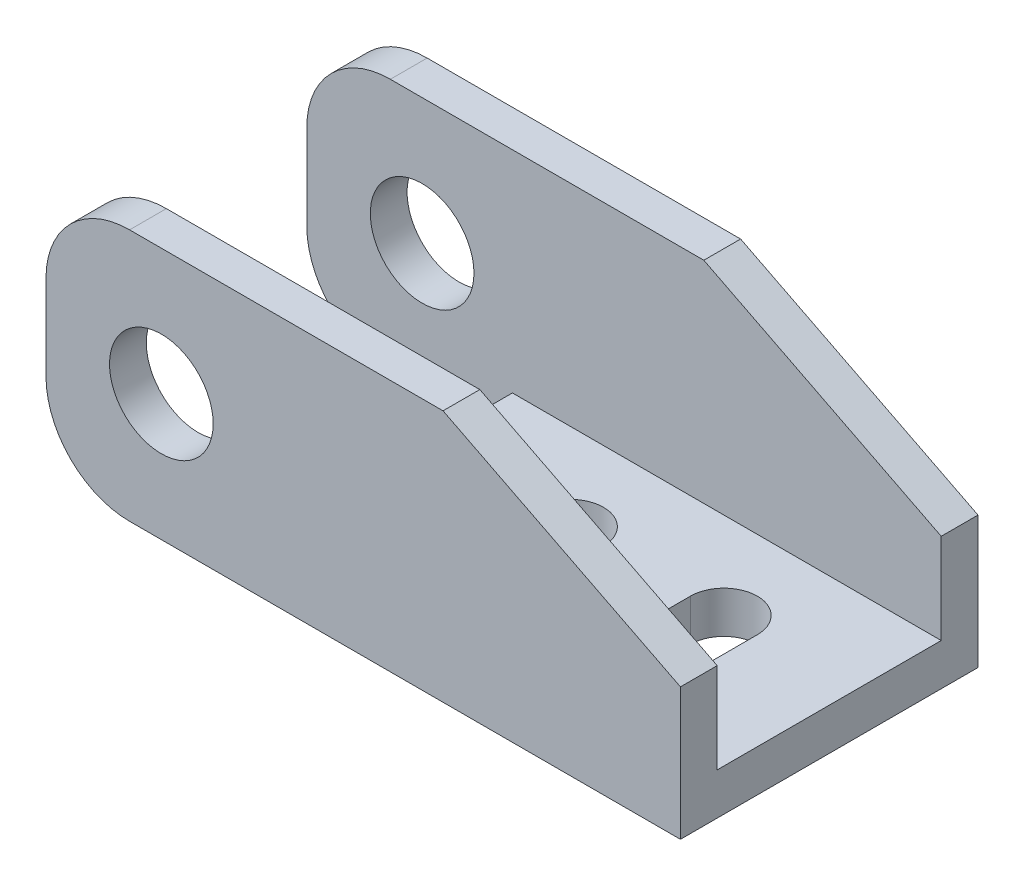
ISO-10303-21;
HEADER;
FILE_DESCRIPTION(('STEP AP214'),'2;1');
FILE_NAME('part.step','',(''),(''),'','','');
FILE_SCHEMA(('AUTOMOTIVE_DESIGN { 1 0 10303 214 1 1 1 1 }'));
ENDSEC;
DATA;
#1=APPLICATION_CONTEXT('core data for automotive mechanical design processes');
#2=APPLICATION_PROTOCOL_DEFINITION('international standard','automotive_design',2000,#1);
#3=PRODUCT_CONTEXT('',#1,'mechanical');
#4=PRODUCT('Part','Part','',(#3));
#5=PRODUCT_RELATED_PRODUCT_CATEGORY('part','',(#4));
#6=PRODUCT_DEFINITION_FORMATION('','',#4);
#7=PRODUCT_DEFINITION_CONTEXT('part definition',#1,'design');
#8=PRODUCT_DEFINITION('design','',#6,#7);
#9=PRODUCT_DEFINITION_SHAPE('','',#8);
#10=(LENGTH_UNIT() NAMED_UNIT(*) SI_UNIT(.MILLI.,.METRE.));
#11=(NAMED_UNIT(*) PLANE_ANGLE_UNIT() SI_UNIT($,.RADIAN.));
#12=(NAMED_UNIT(*) SI_UNIT($,.STERADIAN.) SOLID_ANGLE_UNIT());
#13=UNCERTAINTY_MEASURE_WITH_UNIT(LENGTH_MEASURE(1.E-05),#10,'distance_accuracy_value','');
#14=(GEOMETRIC_REPRESENTATION_CONTEXT(3) GLOBAL_UNCERTAINTY_ASSIGNED_CONTEXT((#13)) GLOBAL_UNIT_ASSIGNED_CONTEXT((#10,
#11,#12)) REPRESENTATION_CONTEXT('',''));
#15=CARTESIAN_POINT('',(0.,0.,0.));
#16=DIRECTION('',(0.,0.,1.));
#17=DIRECTION('',(1.,0.,0.));
#18=AXIS2_PLACEMENT_3D('',#15,#16,#17);
#19=CARTESIAN_POINT('',(12.825,2.5,8.9));
#20=DIRECTION('',(-1.,0.,0.));
#21=DIRECTION('',(0.,0.,1.));
#22=AXIS2_PLACEMENT_3D('',#19,#20,#21);
#23=PLANE('',#22);
#24=DIRECTION('',(0.,0.,-1.));
#25=VECTOR('',#24,1.);
#26=CARTESIAN_POINT('',(12.825,0.,8.9));
#27=LINE('',#26,#25);
#28=CARTESIAN_POINT('',(12.825,0.,8.9));
#29=VERTEX_POINT('',#28);
#30=CARTESIAN_POINT('',(12.825,0.,-8.9));
#31=VERTEX_POINT('',#30);
#32=EDGE_CURVE('E341',#29,#31,#27,.T.);
#33=ORIENTED_EDGE('',*,*,#32,.T.);
#34=DIRECTION('',(0.,-1.,0.));
#35=VECTOR('',#34,1.);
#36=CARTESIAN_POINT('',(12.825,2.5,-8.9));
#37=LINE('',#36,#35);
#38=CARTESIAN_POINT('',(12.825,7.9,-8.9));
#39=VERTEX_POINT('',#38);
#40=EDGE_CURVE('E358',#39,#31,#37,.T.);
#41=ORIENTED_EDGE('',*,*,#40,.F.);
#42=DIRECTION('',(0.,0.,-1.));
#43=VECTOR('',#42,1.);
#44=CARTESIAN_POINT('',(12.825,7.9,-6.7));
#45=LINE('',#44,#43);
#46=CARTESIAN_POINT('',(12.825,7.9,-6.7));
#47=VERTEX_POINT('',#46);
#48=EDGE_CURVE('E300',#47,#39,#45,.T.);
#49=ORIENTED_EDGE('',*,*,#48,.F.);
#50=DIRECTION('',(0.,1.,0.));
#51=VECTOR('',#50,1.);
#52=CARTESIAN_POINT('',(12.825,7.9,-6.7));
#53=LINE('',#52,#51);
#54=CARTESIAN_POINT('',(12.825,2.5,-6.7));
#55=VERTEX_POINT('',#54);
#56=EDGE_CURVE('E289',#55,#47,#53,.T.);
#57=ORIENTED_EDGE('',*,*,#56,.F.);
#58=DIRECTION('',(0.,0.,-1.));
#59=VECTOR('',#58,1.);
#60=CARTESIAN_POINT('',(12.825,2.5,8.9));
#61=LINE('',#60,#59);
#62=CARTESIAN_POINT('',(12.825,2.5,6.7));
#63=VERTEX_POINT('',#62);
#64=EDGE_CURVE('E342',#63,#55,#61,.T.);
#65=ORIENTED_EDGE('',*,*,#64,.F.);
#66=DIRECTION('',(0.,1.,0.));
#67=VECTOR('',#66,1.);
#68=CARTESIAN_POINT('',(12.825,7.9,6.7));
#69=LINE('',#68,#67);
#70=CARTESIAN_POINT('',(12.825,7.9,6.7));
#71=VERTEX_POINT('',#70);
#72=EDGE_CURVE('E316',#63,#71,#69,.T.);
#73=ORIENTED_EDGE('',*,*,#72,.T.);
#74=DIRECTION('',(0.,0.,1.));
#75=VECTOR('',#74,1.);
#76=CARTESIAN_POINT('',(12.825,7.9,6.7));
#77=LINE('',#76,#75);
#78=CARTESIAN_POINT('',(12.825,7.9,8.9));
#79=VERTEX_POINT('',#78);
#80=EDGE_CURVE('E324',#71,#79,#77,.T.);
#81=ORIENTED_EDGE('',*,*,#80,.T.);
#82=DIRECTION('',(0.,-1.,0.));
#83=VECTOR('',#82,1.);
#84=CARTESIAN_POINT('',(12.825,2.5,8.9));
#85=LINE('',#84,#83);
#86=EDGE_CURVE('E347',#79,#29,#85,.T.);
#87=ORIENTED_EDGE('',*,*,#86,.T.);
#88=EDGE_LOOP('',(#33,#41,#49,#57,#65,#73,#81,#87));
#89=FACE_BOUND('',#88,.T.);
#90=ADVANCED_FACE('F32',(#89),#23,.F.);
#91=CARTESIAN_POINT('',(-12.825,2.5,-8.9));
#92=DIRECTION('',(0.,0.,1.));
#93=DIRECTION('',(1.,0.,0.));
#94=AXIS2_PLACEMENT_3D('',#91,#92,#93);
#95=PLANE('',#94);
#96=CARTESIAN_POINT('',(-18.225,7.55,-8.9));
#97=DIRECTION('',(0.,0.,1.));
#98=DIRECTION('',(1.,0.,0.));
#99=AXIS2_PLACEMENT_3D('',#96,#97,#98);
#100=CIRCLE('',#99,3.1);
#101=CARTESIAN_POINT('',(-15.125,7.55,-8.9));
#102=VERTEX_POINT('',#101);
#103=EDGE_CURVE('E270',#102,#102,#100,.T.);
#104=ORIENTED_EDGE('',*,*,#103,.T.);
#105=EDGE_LOOP('',(#104));
#106=FACE_BOUND('',#105,.T.);
#107=DIRECTION('',(-1.,0.,0.));
#108=VECTOR('',#107,1.);
#109=CARTESIAN_POINT('',(-12.825,0.,-8.9));
#110=LINE('',#109,#108);
#111=CARTESIAN_POINT('',(-20.125,0.,-8.9));
#112=VERTEX_POINT('',#111);
#113=EDGE_CURVE('E349',#31,#112,#110,.T.);
#114=ORIENTED_EDGE('',*,*,#113,.T.);
#115=CARTESIAN_POINT('',(-20.125,5.,-8.9));
#116=DIRECTION('',(0.,0.,1.));
#117=DIRECTION('',(1.,0.,0.));
#118=AXIS2_PLACEMENT_3D('',#115,#116,#117);
#119=CIRCLE('',#118,5.);
#120=CARTESIAN_POINT('',(-25.125,5.,-8.9));
#121=VERTEX_POINT('',#120);
#122=EDGE_CURVE('E370',#112,#121,#119,.F.);
#123=ORIENTED_EDGE('',*,*,#122,.T.);
#124=DIRECTION('',(0.,-1.,0.));
#125=VECTOR('',#124,1.);
#126=CARTESIAN_POINT('',(-25.125,0.,-8.9));
#127=LINE('',#126,#125);
#128=CARTESIAN_POINT('',(-25.125,10.1,-8.9));
#129=VERTEX_POINT('',#128);
#130=EDGE_CURVE('E279',#129,#121,#127,.T.);
#131=ORIENTED_EDGE('',*,*,#130,.F.);
#132=CARTESIAN_POINT('',(-20.125,10.1,-8.9));
#133=DIRECTION('',(0.,0.,1.));
#134=DIRECTION('',(1.,0.,0.));
#135=AXIS2_PLACEMENT_3D('',#132,#133,#134);
#136=CIRCLE('',#135,5.);
#137=CARTESIAN_POINT('',(-20.125,15.1,-8.9));
#138=VERTEX_POINT('',#137);
#139=EDGE_CURVE('E368',#129,#138,#136,.F.);
#140=ORIENTED_EDGE('',*,*,#139,.T.);
#141=DIRECTION('',(-1.,0.,0.));
#142=VECTOR('',#141,1.);
#143=CARTESIAN_POINT('',(-25.125,15.1,-8.9));
#144=LINE('',#143,#142);
#145=CARTESIAN_POINT('',(-1.375,15.1,-8.9));
#146=VERTEX_POINT('',#145);
#147=EDGE_CURVE('E296',#146,#138,#144,.T.);
#148=ORIENTED_EDGE('',*,*,#147,.F.);
#149=DIRECTION('',(-0.891900680243053,0.452231330827464,0.));
#150=VECTOR('',#149,1.);
#151=CARTESIAN_POINT('',(-1.375,15.1,-8.9));
#152=LINE('',#151,#150);
#153=EDGE_CURVE('E284',#39,#146,#152,.T.);
#154=ORIENTED_EDGE('',*,*,#153,.F.);
#155=ORIENTED_EDGE('',*,*,#40,.T.);
#156=EDGE_LOOP('',(#114,#123,#131,#140,#148,#154,#155));
#157=FACE_BOUND('',#156,.T.);
#158=ADVANCED_FACE('F441',(#106,#157),#95,.F.);
#159=CARTESIAN_POINT('',(-12.825,2.5,8.9));
#160=DIRECTION('',(1.,0.,0.));
#161=DIRECTION('',(0.,0.,-1.));
#162=AXIS2_PLACEMENT_3D('',#159,#160,#161);
#163=PLANE('',#162);
#164=DIRECTION('',(0.,0.,1.));
#165=VECTOR('',#164,1.);
#166=CARTESIAN_POINT('',(-12.825,2.5,8.9));
#167=LINE('',#166,#165);
#168=CARTESIAN_POINT('',(-12.825,2.5,-6.7));
#169=VERTEX_POINT('',#168);
#170=CARTESIAN_POINT('',(-12.825,2.5,6.7));
#171=VERTEX_POINT('',#170);
#172=EDGE_CURVE('E344',#169,#171,#167,.T.);
#173=ORIENTED_EDGE('',*,*,#172,.F.);
#174=DIRECTION('',(0.,-1.,0.));
#175=VECTOR('',#174,1.);
#176=CARTESIAN_POINT('',(-12.825,2.5,-6.7));
#177=LINE('',#176,#175);
#178=CARTESIAN_POINT('',(-12.825,0.,-6.7));
#179=VERTEX_POINT('',#178);
#180=EDGE_CURVE('E307',#169,#179,#177,.T.);
#181=ORIENTED_EDGE('',*,*,#180,.T.);
#182=DIRECTION('',(0.,0.,1.));
#183=VECTOR('',#182,1.);
#184=CARTESIAN_POINT('',(-12.825,0.,8.9));
#185=LINE('',#184,#183);
#186=CARTESIAN_POINT('',(-12.825,0.,6.7));
#187=VERTEX_POINT('',#186);
#188=EDGE_CURVE('E352',#179,#187,#185,.T.);
#189=ORIENTED_EDGE('',*,*,#188,.T.);
#190=DIRECTION('',(0.,1.,0.));
#191=VECTOR('',#190,1.);
#192=CARTESIAN_POINT('',(-12.825,2.5,6.7));
#193=LINE('',#192,#191);
#194=EDGE_CURVE('E338',#187,#171,#193,.T.);
#195=ORIENTED_EDGE('',*,*,#194,.T.);
#196=EDGE_LOOP('',(#173,#181,#189,#195));
#197=FACE_BOUND('',#196,.T.);
#198=ADVANCED_FACE('F430',(#197),#163,.F.);
#199=CARTESIAN_POINT('',(-12.825,2.5,8.9));
#200=DIRECTION('',(0.,0.,-1.));
#201=DIRECTION('',(-1.,0.,0.));
#202=AXIS2_PLACEMENT_3D('',#199,#200,#201);
#203=PLANE('',#202);
#204=CARTESIAN_POINT('',(-18.225,7.55,8.9));
#205=DIRECTION('',(0.,0.,1.));
#206=DIRECTION('',(1.,0.,0.));
#207=AXIS2_PLACEMENT_3D('',#204,#205,#206);
#208=CIRCLE('',#207,3.1);
#209=CARTESIAN_POINT('',(-15.125,7.55,8.9));
#210=VERTEX_POINT('',#209);
#211=EDGE_CURVE('E269',#210,#210,#208,.T.);
#212=ORIENTED_EDGE('',*,*,#211,.F.);
#213=EDGE_LOOP('',(#212));
#214=FACE_BOUND('',#213,.T.);
#215=DIRECTION('',(-1.,0.,0.));
#216=VECTOR('',#215,1.);
#217=CARTESIAN_POINT('',(-25.125,15.1,8.9));
#218=LINE('',#217,#216);
#219=CARTESIAN_POINT('',(-1.375,15.1,8.9));
#220=VERTEX_POINT('',#219);
#221=CARTESIAN_POINT('',(-20.125,15.1,8.9));
#222=VERTEX_POINT('',#221);
#223=EDGE_CURVE('E314',#220,#222,#218,.T.);
#224=ORIENTED_EDGE('',*,*,#223,.T.);
#225=CARTESIAN_POINT('',(-20.125,10.1,8.9));
#226=DIRECTION('',(0.,0.,-1.));
#227=DIRECTION('',(-1.,0.,0.));
#228=AXIS2_PLACEMENT_3D('',#225,#226,#227);
#229=CIRCLE('',#228,5.);
#230=CARTESIAN_POINT('',(-25.125,10.1,8.9));
#231=VERTEX_POINT('',#230);
#232=EDGE_CURVE('E388',#222,#231,#229,.F.);
#233=ORIENTED_EDGE('',*,*,#232,.T.);
#234=DIRECTION('',(0.,-1.,0.));
#235=VECTOR('',#234,1.);
#236=CARTESIAN_POINT('',(-25.125,0.,8.9));
#237=LINE('',#236,#235);
#238=CARTESIAN_POINT('',(-25.125,5.,8.9));
#239=VERTEX_POINT('',#238);
#240=EDGE_CURVE('E310',#231,#239,#237,.T.);
#241=ORIENTED_EDGE('',*,*,#240,.T.);
#242=CARTESIAN_POINT('',(-20.125,5.,8.9));
#243=DIRECTION('',(0.,0.,-1.));
#244=DIRECTION('',(-1.,0.,0.));
#245=AXIS2_PLACEMENT_3D('',#242,#243,#244);
#246=CIRCLE('',#245,5.);
#247=CARTESIAN_POINT('',(-20.125,0.,8.9));
#248=VERTEX_POINT('',#247);
#249=EDGE_CURVE('E386',#239,#248,#246,.F.);
#250=ORIENTED_EDGE('',*,*,#249,.T.);
#251=DIRECTION('',(1.,0.,0.));
#252=VECTOR('',#251,1.);
#253=CARTESIAN_POINT('',(-12.825,0.,8.9));
#254=LINE('',#253,#252);
#255=EDGE_CURVE('E345',#248,#29,#254,.T.);
#256=ORIENTED_EDGE('',*,*,#255,.T.);
#257=ORIENTED_EDGE('',*,*,#86,.F.);
#258=DIRECTION('',(-0.891900680243053,0.452231330827464,0.));
#259=VECTOR('',#258,1.);
#260=CARTESIAN_POINT('',(-1.375,15.1,8.9));
#261=LINE('',#260,#259);
#262=EDGE_CURVE('E327',#79,#220,#261,.T.);
#263=ORIENTED_EDGE('',*,*,#262,.T.);
#264=EDGE_LOOP('',(#224,#233,#241,#250,#256,#257,#263));
#265=FACE_BOUND('',#264,.T.);
#266=ADVANCED_FACE('F397',(#214,#265),#203,.F.);
#267=CARTESIAN_POINT('',(0.,2.5,0.));
#268=DIRECTION('',(0.,-1.,0.));
#269=DIRECTION('',(0.,0.,-1.));
#270=AXIS2_PLACEMENT_3D('',#267,#268,#269);
#271=PLANE('',#270);
#272=DIRECTION('',(0.,0.,-1.));
#273=VECTOR('',#272,1.);
#274=CARTESIAN_POINT('',(3.025,2.5,0.));
#275=LINE('',#274,#273);
#276=CARTESIAN_POINT('',(3.025,2.5,1.5));
#277=VERTEX_POINT('',#276);
#278=CARTESIAN_POINT('',(3.025,2.5,-1.5));
#279=VERTEX_POINT('',#278);
#280=EDGE_CURVE('E231',#277,#279,#275,.T.);
#281=ORIENTED_EDGE('',*,*,#280,.T.);
#282=CARTESIAN_POINT('',(5.025,2.5,-1.5));
#283=DIRECTION('',(0.,-1.,0.));
#284=DIRECTION('',(0.,0.,-1.));
#285=AXIS2_PLACEMENT_3D('',#282,#283,#284);
#286=CIRCLE('',#285,2.);
#287=CARTESIAN_POINT('',(7.025,2.5,-1.5));
#288=VERTEX_POINT('',#287);
#289=EDGE_CURVE('E234',#279,#288,#286,.T.);
#290=ORIENTED_EDGE('',*,*,#289,.T.);
#291=DIRECTION('',(0.,0.,1.));
#292=VECTOR('',#291,1.);
#293=CARTESIAN_POINT('',(7.025,2.5,0.));
#294=LINE('',#293,#292);
#295=CARTESIAN_POINT('',(7.025,2.5,1.5));
#296=VERTEX_POINT('',#295);
#297=EDGE_CURVE('E226',#288,#296,#294,.T.);
#298=ORIENTED_EDGE('',*,*,#297,.T.);
#299=CARTESIAN_POINT('',(5.025,2.5,1.5));
#300=DIRECTION('',(0.,-1.,0.));
#301=DIRECTION('',(0.,0.,-1.));
#302=AXIS2_PLACEMENT_3D('',#299,#300,#301);
#303=CIRCLE('',#302,2.);
#304=EDGE_CURVE('E201',#296,#277,#303,.T.);
#305=ORIENTED_EDGE('',*,*,#304,.T.);
#306=EDGE_LOOP('',(#281,#290,#298,#305));
#307=FACE_BOUND('',#306,.T.);
#308=DIRECTION('',(0.,0.,1.));
#309=VECTOR('',#308,1.);
#310=CARTESIAN_POINT('',(-2.175,2.5,0.));
#311=LINE('',#310,#309);
#312=CARTESIAN_POINT('',(-2.175,2.5,-1.5));
#313=VERTEX_POINT('',#312);
#314=CARTESIAN_POINT('',(-2.175,2.5,1.5));
#315=VERTEX_POINT('',#314);
#316=EDGE_CURVE('E263',#313,#315,#311,.T.);
#317=ORIENTED_EDGE('',*,*,#316,.T.);
#318=CARTESIAN_POINT('',(-4.175,2.5,1.5));
#319=DIRECTION('',(0.,-1.,0.));
#320=DIRECTION('',(0.,0.,-1.));
#321=AXIS2_PLACEMENT_3D('',#318,#319,#320);
#322=CIRCLE('',#321,2.);
#323=CARTESIAN_POINT('',(-6.175,2.5,1.5));
#324=VERTEX_POINT('',#323);
#325=EDGE_CURVE('E266',#315,#324,#322,.T.);
#326=ORIENTED_EDGE('',*,*,#325,.T.);
#327=DIRECTION('',(0.,0.,-1.));
#328=VECTOR('',#327,1.);
#329=CARTESIAN_POINT('',(-6.175,2.5,0.));
#330=LINE('',#329,#328);
#331=CARTESIAN_POINT('',(-6.175,2.5,-1.5));
#332=VERTEX_POINT('',#331);
#333=EDGE_CURVE('E251',#324,#332,#330,.T.);
#334=ORIENTED_EDGE('',*,*,#333,.T.);
#335=CARTESIAN_POINT('',(-4.175,2.5,-1.5));
#336=DIRECTION('',(0.,-1.,0.));
#337=DIRECTION('',(0.,0.,-1.));
#338=AXIS2_PLACEMENT_3D('',#335,#336,#337);
#339=CIRCLE('',#338,2.);
#340=EDGE_CURVE('E260',#332,#313,#339,.T.);
#341=ORIENTED_EDGE('',*,*,#340,.T.);
#342=EDGE_LOOP('',(#317,#326,#334,#341));
#343=FACE_BOUND('',#342,.T.);
#344=ORIENTED_EDGE('',*,*,#64,.T.);
#345=DIRECTION('',(-1.,0.,0.));
#346=VECTOR('',#345,1.);
#347=CARTESIAN_POINT('',(0.,2.5,-6.7));
#348=LINE('',#347,#346);
#349=EDGE_CURVE('E303',#55,#169,#348,.T.);
#350=ORIENTED_EDGE('',*,*,#349,.T.);
#351=ORIENTED_EDGE('',*,*,#172,.T.);
#352=DIRECTION('',(1.,0.,0.));
#353=VECTOR('',#352,1.);
#354=CARTESIAN_POINT('',(0.,2.5,6.7));
#355=LINE('',#354,#353);
#356=EDGE_CURVE('E334',#171,#63,#355,.T.);
#357=ORIENTED_EDGE('',*,*,#356,.T.);
#358=EDGE_LOOP('',(#344,#350,#351,#357));
#359=FACE_BOUND('',#358,.T.);
#360=ADVANCED_FACE('F422',(#307,#343,#359),#271,.F.);
#361=CARTESIAN_POINT('',(0.,0.,0.));
#362=DIRECTION('',(0.,-1.,0.));
#363=DIRECTION('',(0.,0.,-1.));
#364=AXIS2_PLACEMENT_3D('',#361,#362,#363);
#365=PLANE('',#364);
#366=CARTESIAN_POINT('',(5.025,0.,-1.5));
#367=DIRECTION('',(0.,-1.,0.));
#368=DIRECTION('',(0.,0.,-1.));
#369=AXIS2_PLACEMENT_3D('',#366,#367,#368);
#370=CIRCLE('',#369,2.);
#371=CARTESIAN_POINT('',(3.025,0.,-1.5));
#372=VERTEX_POINT('',#371);
#373=CARTESIAN_POINT('',(7.025,0.,-1.5));
#374=VERTEX_POINT('',#373);
#375=EDGE_CURVE('E214',#372,#374,#370,.T.);
#376=ORIENTED_EDGE('',*,*,#375,.F.);
#377=DIRECTION('',(0.,0.,-1.));
#378=VECTOR('',#377,1.);
#379=CARTESIAN_POINT('',(3.025,0.,-1.5));
#380=LINE('',#379,#378);
#381=CARTESIAN_POINT('',(3.025,0.,1.5));
#382=VERTEX_POINT('',#381);
#383=EDGE_CURVE('E219',#382,#372,#380,.T.);
#384=ORIENTED_EDGE('',*,*,#383,.F.);
#385=CARTESIAN_POINT('',(5.025,0.,1.5));
#386=DIRECTION('',(0.,-1.,0.));
#387=DIRECTION('',(0.,0.,-1.));
#388=AXIS2_PLACEMENT_3D('',#385,#386,#387);
#389=CIRCLE('',#388,2.);
#390=CARTESIAN_POINT('',(7.025,0.,1.5));
#391=VERTEX_POINT('',#390);
#392=EDGE_CURVE('E198',#391,#382,#389,.T.);
#393=ORIENTED_EDGE('',*,*,#392,.F.);
#394=DIRECTION('',(0.,0.,1.));
#395=VECTOR('',#394,1.);
#396=CARTESIAN_POINT('',(7.025,0.,-1.5));
#397=LINE('',#396,#395);
#398=EDGE_CURVE('E209',#374,#391,#397,.T.);
#399=ORIENTED_EDGE('',*,*,#398,.F.);
#400=EDGE_LOOP('',(#376,#384,#393,#399));
#401=FACE_BOUND('',#400,.T.);
#402=CARTESIAN_POINT('',(-4.175,0.,1.5));
#403=DIRECTION('',(0.,-1.,0.));
#404=DIRECTION('',(0.,0.,-1.));
#405=AXIS2_PLACEMENT_3D('',#402,#403,#404);
#406=CIRCLE('',#405,2.);
#407=CARTESIAN_POINT('',(-2.175,0.,1.5));
#408=VERTEX_POINT('',#407);
#409=CARTESIAN_POINT('',(-6.175,0.,1.5));
#410=VERTEX_POINT('',#409);
#411=EDGE_CURVE('E237',#408,#410,#406,.T.);
#412=ORIENTED_EDGE('',*,*,#411,.F.);
#413=DIRECTION('',(0.,0.,1.));
#414=VECTOR('',#413,1.);
#415=CARTESIAN_POINT('',(-2.175,0.,1.5));
#416=LINE('',#415,#414);
#417=CARTESIAN_POINT('',(-2.175,0.,-1.5));
#418=VERTEX_POINT('',#417);
#419=EDGE_CURVE('E245',#418,#408,#416,.T.);
#420=ORIENTED_EDGE('',*,*,#419,.F.);
#421=CARTESIAN_POINT('',(-4.175,0.,-1.5));
#422=DIRECTION('',(0.,-1.,0.));
#423=DIRECTION('',(0.,0.,-1.));
#424=AXIS2_PLACEMENT_3D('',#421,#422,#423);
#425=CIRCLE('',#424,2.);
#426=CARTESIAN_POINT('',(-6.175,0.,-1.5));
#427=VERTEX_POINT('',#426);
#428=EDGE_CURVE('E242',#427,#418,#425,.T.);
#429=ORIENTED_EDGE('',*,*,#428,.F.);
#430=DIRECTION('',(0.,0.,-1.));
#431=VECTOR('',#430,1.);
#432=CARTESIAN_POINT('',(-6.175,0.,1.5));
#433=LINE('',#432,#431);
#434=EDGE_CURVE('E239',#410,#427,#433,.T.);
#435=ORIENTED_EDGE('',*,*,#434,.F.);
#436=EDGE_LOOP('',(#412,#420,#429,#435));
#437=FACE_BOUND('',#436,.T.);
#438=DIRECTION('',(1.,0.,0.));
#439=VECTOR('',#438,1.);
#440=CARTESIAN_POINT('',(-25.125,0.,-6.7));
#441=LINE('',#440,#439);
#442=CARTESIAN_POINT('',(-20.125,0.,-6.7));
#443=VERTEX_POINT('',#442);
#444=EDGE_CURVE('E291',#443,#179,#441,.T.);
#445=ORIENTED_EDGE('',*,*,#444,.F.);
#446=DIRECTION('',(0.,0.,-1.));
#447=VECTOR('',#446,1.);
#448=CARTESIAN_POINT('',(-20.125,0.,-8.9));
#449=LINE('',#448,#447);
#450=EDGE_CURVE('E365',#443,#112,#449,.T.);
#451=ORIENTED_EDGE('',*,*,#450,.T.);
#452=ORIENTED_EDGE('',*,*,#113,.F.);
#453=ORIENTED_EDGE('',*,*,#32,.F.);
#454=ORIENTED_EDGE('',*,*,#255,.F.);
#455=DIRECTION('',(0.,0.,1.));
#456=VECTOR('',#455,1.);
#457=CARTESIAN_POINT('',(-20.125,0.,0.));
#458=LINE('',#457,#456);
#459=CARTESIAN_POINT('',(-20.125,0.,6.7));
#460=VERTEX_POINT('',#459);
#461=EDGE_CURVE('E361',#248,#460,#458,.F.);
#462=ORIENTED_EDGE('',*,*,#461,.T.);
#463=DIRECTION('',(1.,0.,0.));
#464=VECTOR('',#463,1.);
#465=CARTESIAN_POINT('',(-25.125,0.,6.7));
#466=LINE('',#465,#464);
#467=EDGE_CURVE('E313',#460,#187,#466,.T.);
#468=ORIENTED_EDGE('',*,*,#467,.T.);
#469=ORIENTED_EDGE('',*,*,#188,.F.);
#470=EDGE_LOOP('',(#445,#451,#452,#453,#454,#462,#468,#469));
#471=FACE_BOUND('',#470,.T.);
#472=ADVANCED_FACE('F216',(#401,#437,#471),#365,.T.);
#473=CARTESIAN_POINT('',(0.,0.,6.7));
#474=DIRECTION('',(0.,0.,-1.));
#475=DIRECTION('',(-1.,0.,0.));
#476=AXIS2_PLACEMENT_3D('',#473,#474,#475);
#477=PLANE('',#476);
#478=CARTESIAN_POINT('',(-18.225,7.55,6.7));
#479=DIRECTION('',(0.,0.,-1.));
#480=DIRECTION('',(-1.,0.,0.));
#481=AXIS2_PLACEMENT_3D('',#478,#479,#480);
#482=CIRCLE('',#481,3.1);
#483=CARTESIAN_POINT('',(-21.325,7.55,6.7));
#484=VERTEX_POINT('',#483);
#485=EDGE_CURVE('E276',#484,#484,#482,.T.);
#486=ORIENTED_EDGE('',*,*,#485,.F.);
#487=EDGE_LOOP('',(#486));
#488=FACE_BOUND('',#487,.T.);
#489=DIRECTION('',(0.,-1.,0.));
#490=VECTOR('',#489,1.);
#491=CARTESIAN_POINT('',(-25.125,0.,6.7));
#492=LINE('',#491,#490);
#493=CARTESIAN_POINT('',(-25.125,10.1,6.7));
#494=VERTEX_POINT('',#493);
#495=CARTESIAN_POINT('',(-25.125,5.,6.7));
#496=VERTEX_POINT('',#495);
#497=EDGE_CURVE('E311',#494,#496,#492,.T.);
#498=ORIENTED_EDGE('',*,*,#497,.F.);
#499=CARTESIAN_POINT('',(-20.125,10.1,6.7));
#500=DIRECTION('',(0.,0.,-1.));
#501=DIRECTION('',(-1.,0.,0.));
#502=AXIS2_PLACEMENT_3D('',#499,#500,#501);
#503=CIRCLE('',#502,5.);
#504=CARTESIAN_POINT('',(-20.125,15.1,6.7));
#505=VERTEX_POINT('',#504);
#506=EDGE_CURVE('E11',#494,#505,#503,.T.);
#507=ORIENTED_EDGE('',*,*,#506,.T.);
#508=DIRECTION('',(-1.,0.,0.));
#509=VECTOR('',#508,1.);
#510=CARTESIAN_POINT('',(-25.125,15.1,6.7));
#511=LINE('',#510,#509);
#512=CARTESIAN_POINT('',(-1.375,15.1,6.7));
#513=VERTEX_POINT('',#512);
#514=EDGE_CURVE('E321',#513,#505,#511,.T.);
#515=ORIENTED_EDGE('',*,*,#514,.F.);
#516=DIRECTION('',(-0.891900680243053,0.452231330827464,0.));
#517=VECTOR('',#516,1.);
#518=CARTESIAN_POINT('',(-1.375,15.1,6.7));
#519=LINE('',#518,#517);
#520=EDGE_CURVE('E318',#71,#513,#519,.T.);
#521=ORIENTED_EDGE('',*,*,#520,.F.);
#522=ORIENTED_EDGE('',*,*,#72,.F.);
#523=ORIENTED_EDGE('',*,*,#356,.F.);
#524=ORIENTED_EDGE('',*,*,#194,.F.);
#525=ORIENTED_EDGE('',*,*,#467,.F.);
#526=CARTESIAN_POINT('',(-20.125,5.,6.7));
#527=DIRECTION('',(0.,0.,-1.));
#528=DIRECTION('',(-1.,0.,0.));
#529=AXIS2_PLACEMENT_3D('',#526,#527,#528);
#530=CIRCLE('',#529,5.);
#531=EDGE_CURVE('E40',#460,#496,#530,.T.);
#532=ORIENTED_EDGE('',*,*,#531,.T.);
#533=EDGE_LOOP('',(#498,#507,#515,#521,#522,#523,#524,#525,#532));
#534=FACE_BOUND('',#533,.T.);
#535=ADVANCED_FACE('F408',(#488,#534),#477,.T.);
#536=CARTESIAN_POINT('',(-25.125,0.,6.7));
#537=DIRECTION('',(-1.,0.,0.));
#538=DIRECTION('',(0.,0.,1.));
#539=AXIS2_PLACEMENT_3D('',#536,#537,#538);
#540=PLANE('',#539);
#541=ORIENTED_EDGE('',*,*,#240,.F.);
#542=DIRECTION('',(0.,0.,1.));
#543=VECTOR('',#542,1.);
#544=CARTESIAN_POINT('',(-25.125,10.1,6.7));
#545=LINE('',#544,#543);
#546=EDGE_CURVE('E53',#231,#494,#545,.F.);
#547=ORIENTED_EDGE('',*,*,#546,.T.);
#548=ORIENTED_EDGE('',*,*,#497,.T.);
#549=DIRECTION('',(0.,0.,1.));
#550=VECTOR('',#549,1.);
#551=CARTESIAN_POINT('',(-25.125,5.,6.7));
#552=LINE('',#551,#550);
#553=EDGE_CURVE('E390',#496,#239,#552,.T.);
#554=ORIENTED_EDGE('',*,*,#553,.T.);
#555=EDGE_LOOP('',(#541,#547,#548,#554));
#556=FACE_BOUND('',#555,.T.);
#557=ADVANCED_FACE('F394',(#556),#540,.T.);
#558=CARTESIAN_POINT('',(-25.125,15.1,6.7));
#559=DIRECTION('',(0.,1.,0.));
#560=DIRECTION('',(0.,0.,1.));
#561=AXIS2_PLACEMENT_3D('',#558,#559,#560);
#562=PLANE('',#561);
#563=ORIENTED_EDGE('',*,*,#514,.T.);
#564=DIRECTION('',(0.,0.,1.));
#565=VECTOR('',#564,1.);
#566=CARTESIAN_POINT('',(-20.125,15.1,6.7));
#567=LINE('',#566,#565);
#568=EDGE_CURVE('E383',#505,#222,#567,.T.);
#569=ORIENTED_EDGE('',*,*,#568,.T.);
#570=ORIENTED_EDGE('',*,*,#223,.F.);
#571=DIRECTION('',(0.,0.,1.));
#572=VECTOR('',#571,1.);
#573=CARTESIAN_POINT('',(-1.375,15.1,6.7));
#574=LINE('',#573,#572);
#575=EDGE_CURVE('E332',#513,#220,#574,.T.);
#576=ORIENTED_EDGE('',*,*,#575,.F.);
#577=EDGE_LOOP('',(#563,#569,#570,#576));
#578=FACE_BOUND('',#577,.T.);
#579=ADVANCED_FACE('F405',(#578),#562,.T.);
#580=CARTESIAN_POINT('',(-1.375,15.1,6.7));
#581=DIRECTION('',(0.452231330827463,0.891900680243053,0.));
#582=DIRECTION('',(-0.891900680243053,0.452231330827464,0.));
#583=AXIS2_PLACEMENT_3D('',#580,#581,#582);
#584=PLANE('',#583);
#585=ORIENTED_EDGE('',*,*,#262,.F.);
#586=ORIENTED_EDGE('',*,*,#80,.F.);
#587=ORIENTED_EDGE('',*,*,#520,.T.);
#588=ORIENTED_EDGE('',*,*,#575,.T.);
#589=EDGE_LOOP('',(#585,#586,#587,#588));
#590=FACE_BOUND('',#589,.T.);
#591=ADVANCED_FACE('F414',(#590),#584,.T.);
#592=CARTESIAN_POINT('',(0.,0.,-6.7));
#593=DIRECTION('',(0.,0.,1.));
#594=DIRECTION('',(-1.,0.,0.));
#595=AXIS2_PLACEMENT_3D('',#592,#593,#594);
#596=PLANE('',#595);
#597=CARTESIAN_POINT('',(-18.225,7.55,-6.7));
#598=DIRECTION('',(0.,0.,1.));
#599=DIRECTION('',(1.,0.,0.));
#600=AXIS2_PLACEMENT_3D('',#597,#598,#599);
#601=CIRCLE('',#600,3.1);
#602=CARTESIAN_POINT('',(-15.125,7.55,-6.7));
#603=VERTEX_POINT('',#602);
#604=EDGE_CURVE('E273',#603,#603,#601,.T.);
#605=ORIENTED_EDGE('',*,*,#604,.F.);
#606=EDGE_LOOP('',(#605));
#607=FACE_BOUND('',#606,.T.);
#608=DIRECTION('',(0.,-1.,0.));
#609=VECTOR('',#608,1.);
#610=CARTESIAN_POINT('',(-25.125,0.,-6.7));
#611=LINE('',#610,#609);
#612=CARTESIAN_POINT('',(-25.125,10.1,-6.7));
#613=VERTEX_POINT('',#612);
#614=CARTESIAN_POINT('',(-25.125,5.,-6.7));
#615=VERTEX_POINT('',#614);
#616=EDGE_CURVE('E280',#613,#615,#611,.T.);
#617=ORIENTED_EDGE('',*,*,#616,.T.);
#618=CARTESIAN_POINT('',(-20.125,5.,-6.7));
#619=DIRECTION('',(0.,0.,1.));
#620=DIRECTION('',(1.,0.,0.));
#621=AXIS2_PLACEMENT_3D('',#618,#619,#620);
#622=CIRCLE('',#621,5.);
#623=EDGE_CURVE('E379',#615,#443,#622,.T.);
#624=ORIENTED_EDGE('',*,*,#623,.T.);
#625=ORIENTED_EDGE('',*,*,#444,.T.);
#626=ORIENTED_EDGE('',*,*,#180,.F.);
#627=ORIENTED_EDGE('',*,*,#349,.F.);
#628=ORIENTED_EDGE('',*,*,#56,.T.);
#629=DIRECTION('',(-0.891900680243053,0.452231330827464,0.));
#630=VECTOR('',#629,1.);
#631=CARTESIAN_POINT('',(-1.375,15.1,-6.7));
#632=LINE('',#631,#630);
#633=CARTESIAN_POINT('',(-1.375,15.1,-6.7));
#634=VERTEX_POINT('',#633);
#635=EDGE_CURVE('E287',#47,#634,#632,.T.);
#636=ORIENTED_EDGE('',*,*,#635,.T.);
#637=DIRECTION('',(-1.,0.,0.));
#638=VECTOR('',#637,1.);
#639=CARTESIAN_POINT('',(-25.125,15.1,-6.7));
#640=LINE('',#639,#638);
#641=CARTESIAN_POINT('',(-20.125,15.1,-6.7));
#642=VERTEX_POINT('',#641);
#643=EDGE_CURVE('E283',#634,#642,#640,.T.);
#644=ORIENTED_EDGE('',*,*,#643,.T.);
#645=CARTESIAN_POINT('',(-20.125,10.1,-6.7));
#646=DIRECTION('',(0.,0.,1.));
#647=DIRECTION('',(1.,0.,0.));
#648=AXIS2_PLACEMENT_3D('',#645,#646,#647);
#649=CIRCLE('',#648,5.);
#650=EDGE_CURVE('E377',#642,#613,#649,.T.);
#651=ORIENTED_EDGE('',*,*,#650,.T.);
#652=EDGE_LOOP('',(#617,#624,#625,#626,#627,#628,#636,#644,#651));
#653=FACE_BOUND('',#652,.T.);
#654=ADVANCED_FACE('F426',(#607,#653),#596,.T.);
#655=CARTESIAN_POINT('',(-25.125,0.,-6.7));
#656=DIRECTION('',(1.,0.,0.));
#657=DIRECTION('',(0.,0.,-1.));
#658=AXIS2_PLACEMENT_3D('',#655,#656,#657);
#659=PLANE('',#658);
#660=ORIENTED_EDGE('',*,*,#130,.T.);
#661=DIRECTION('',(0.,0.,-1.));
#662=VECTOR('',#661,1.);
#663=CARTESIAN_POINT('',(-25.125,5.,-6.7));
#664=LINE('',#663,#662);
#665=EDGE_CURVE('E375',#121,#615,#664,.F.);
#666=ORIENTED_EDGE('',*,*,#665,.T.);
#667=ORIENTED_EDGE('',*,*,#616,.F.);
#668=DIRECTION('',(0.,0.,-1.));
#669=VECTOR('',#668,1.);
#670=CARTESIAN_POINT('',(-25.125,10.1,-6.7));
#671=LINE('',#670,#669);
#672=EDGE_CURVE('E372',#613,#129,#671,.T.);
#673=ORIENTED_EDGE('',*,*,#672,.T.);
#674=EDGE_LOOP('',(#660,#666,#667,#673));
#675=FACE_BOUND('',#674,.T.);
#676=ADVANCED_FACE('F465',(#675),#659,.F.);
#677=CARTESIAN_POINT('',(-1.375,15.1,-6.7));
#678=DIRECTION('',(-0.452231330827463,-0.891900680243053,0.));
#679=DIRECTION('',(0.891900680243053,-0.452231330827464,0.));
#680=AXIS2_PLACEMENT_3D('',#677,#678,#679);
#681=PLANE('',#680);
#682=ORIENTED_EDGE('',*,*,#153,.T.);
#683=DIRECTION('',(0.,0.,-1.));
#684=VECTOR('',#683,1.);
#685=CARTESIAN_POINT('',(-1.375,15.1,-6.7));
#686=LINE('',#685,#684);
#687=EDGE_CURVE('E293',#634,#146,#686,.T.);
#688=ORIENTED_EDGE('',*,*,#687,.F.);
#689=ORIENTED_EDGE('',*,*,#635,.F.);
#690=ORIENTED_EDGE('',*,*,#48,.T.);
#691=EDGE_LOOP('',(#682,#688,#689,#690));
#692=FACE_BOUND('',#691,.T.);
#693=ADVANCED_FACE('F474',(#692),#681,.F.);
#694=CARTESIAN_POINT('',(-25.125,15.1,-6.7));
#695=DIRECTION('',(0.,-1.,0.));
#696=DIRECTION('',(0.,0.,-1.));
#697=AXIS2_PLACEMENT_3D('',#694,#695,#696);
#698=PLANE('',#697);
#699=ORIENTED_EDGE('',*,*,#147,.T.);
#700=DIRECTION('',(0.,0.,-1.));
#701=VECTOR('',#700,1.);
#702=CARTESIAN_POINT('',(-20.125,15.1,-6.7));
#703=LINE('',#702,#701);
#704=EDGE_CURVE('E381',#138,#642,#703,.F.);
#705=ORIENTED_EDGE('',*,*,#704,.T.);
#706=ORIENTED_EDGE('',*,*,#643,.F.);
#707=ORIENTED_EDGE('',*,*,#687,.T.);
#708=EDGE_LOOP('',(#699,#705,#706,#707));
#709=FACE_BOUND('',#708,.T.);
#710=ADVANCED_FACE('F477',(#709),#698,.F.);
#711=CARTESIAN_POINT('',(-18.225,7.55,-8.9));
#712=DIRECTION('',(0.,0.,1.));
#713=DIRECTION('',(1.,0.,0.));
#714=AXIS2_PLACEMENT_3D('',#711,#712,#713);
#715=CYLINDRICAL_SURFACE('',#714,3.1);
#716=ORIENTED_EDGE('',*,*,#604,.T.);
#717=EDGE_LOOP('',(#716));
#718=FACE_BOUND('',#717,.T.);
#719=ORIENTED_EDGE('',*,*,#103,.F.);
#720=EDGE_LOOP('',(#719));
#721=FACE_BOUND('',#720,.T.);
#722=ADVANCED_FACE('F479',(#718,#721),#715,.F.);
#723=ORIENTED_EDGE('',*,*,#485,.T.);
#724=EDGE_LOOP('',(#723));
#725=FACE_BOUND('',#724,.T.);
#726=ORIENTED_EDGE('',*,*,#211,.T.);
#727=EDGE_LOOP('',(#726));
#728=FACE_BOUND('',#727,.T.);
#729=ADVANCED_FACE('F485',(#725,#728),#715,.F.);
#730=CARTESIAN_POINT('',(-4.175,15.1,1.5));
#731=DIRECTION('',(0.,-1.,0.));
#732=DIRECTION('',(0.,0.,-1.));
#733=AXIS2_PLACEMENT_3D('',#730,#731,#732);
#734=CYLINDRICAL_SURFACE('',#733,2.);
#735=DIRECTION('',(0.,-1.,0.));
#736=VECTOR('',#735,1.);
#737=CARTESIAN_POINT('',(-2.175,15.1,1.5));
#738=LINE('',#737,#736);
#739=EDGE_CURVE('E249',#315,#408,#738,.T.);
#740=ORIENTED_EDGE('',*,*,#739,.T.);
#741=ORIENTED_EDGE('',*,*,#411,.T.);
#742=DIRECTION('',(0.,-1.,0.));
#743=VECTOR('',#742,1.);
#744=CARTESIAN_POINT('',(-6.175,15.1,1.5));
#745=LINE('',#744,#743);
#746=EDGE_CURVE('E248',#324,#410,#745,.T.);
#747=ORIENTED_EDGE('',*,*,#746,.F.);
#748=ORIENTED_EDGE('',*,*,#325,.F.);
#749=EDGE_LOOP('',(#740,#741,#747,#748));
#750=FACE_BOUND('',#749,.T.);
#751=ADVANCED_FACE('F572',(#750),#734,.F.);
#752=CARTESIAN_POINT('',(-2.175,15.1,1.5));
#753=DIRECTION('',(1.,0.,0.));
#754=DIRECTION('',(0.,0.,-1.));
#755=AXIS2_PLACEMENT_3D('',#752,#753,#754);
#756=PLANE('',#755);
#757=DIRECTION('',(0.,-1.,0.));
#758=VECTOR('',#757,1.);
#759=CARTESIAN_POINT('',(-2.175,15.1,-1.5));
#760=LINE('',#759,#758);
#761=EDGE_CURVE('E252',#313,#418,#760,.T.);
#762=ORIENTED_EDGE('',*,*,#761,.T.);
#763=ORIENTED_EDGE('',*,*,#419,.T.);
#764=ORIENTED_EDGE('',*,*,#739,.F.);
#765=ORIENTED_EDGE('',*,*,#316,.F.);
#766=EDGE_LOOP('',(#762,#763,#764,#765));
#767=FACE_BOUND('',#766,.T.);
#768=ADVANCED_FACE('F581',(#767),#756,.F.);
#769=CARTESIAN_POINT('',(-4.175,15.1,-1.5));
#770=DIRECTION('',(0.,-1.,0.));
#771=DIRECTION('',(0.,0.,-1.));
#772=AXIS2_PLACEMENT_3D('',#769,#770,#771);
#773=CYLINDRICAL_SURFACE('',#772,2.);
#774=DIRECTION('',(0.,-1.,0.));
#775=VECTOR('',#774,1.);
#776=CARTESIAN_POINT('',(-6.175,15.1,-1.5));
#777=LINE('',#776,#775);
#778=EDGE_CURVE('E254',#332,#427,#777,.T.);
#779=ORIENTED_EDGE('',*,*,#778,.T.);
#780=ORIENTED_EDGE('',*,*,#428,.T.);
#781=ORIENTED_EDGE('',*,*,#761,.F.);
#782=ORIENTED_EDGE('',*,*,#340,.F.);
#783=EDGE_LOOP('',(#779,#780,#781,#782));
#784=FACE_BOUND('',#783,.T.);
#785=ADVANCED_FACE('F588',(#784),#773,.F.);
#786=CARTESIAN_POINT('',(-6.175,15.1,1.5));
#787=DIRECTION('',(-1.,0.,0.));
#788=DIRECTION('',(0.,0.,1.));
#789=AXIS2_PLACEMENT_3D('',#786,#787,#788);
#790=PLANE('',#789);
#791=ORIENTED_EDGE('',*,*,#746,.T.);
#792=ORIENTED_EDGE('',*,*,#434,.T.);
#793=ORIENTED_EDGE('',*,*,#778,.F.);
#794=ORIENTED_EDGE('',*,*,#333,.F.);
#795=EDGE_LOOP('',(#791,#792,#793,#794));
#796=FACE_BOUND('',#795,.T.);
#797=ADVANCED_FACE('F596',(#796),#790,.F.);
#798=CARTESIAN_POINT('',(5.025,15.1,-1.5));
#799=DIRECTION('',(0.,-1.,0.));
#800=DIRECTION('',(0.,0.,-1.));
#801=AXIS2_PLACEMENT_3D('',#798,#799,#800);
#802=CYLINDRICAL_SURFACE('',#801,2.);
#803=DIRECTION('',(0.,-1.,0.));
#804=VECTOR('',#803,1.);
#805=CARTESIAN_POINT('',(3.025,15.1,-1.5));
#806=LINE('',#805,#804);
#807=EDGE_CURVE('E224',#279,#372,#806,.T.);
#808=ORIENTED_EDGE('',*,*,#807,.T.);
#809=ORIENTED_EDGE('',*,*,#375,.T.);
#810=DIRECTION('',(0.,-1.,0.));
#811=VECTOR('',#810,1.);
#812=CARTESIAN_POINT('',(7.025,15.1,-1.5));
#813=LINE('',#812,#811);
#814=EDGE_CURVE('E205',#288,#374,#813,.T.);
#815=ORIENTED_EDGE('',*,*,#814,.F.);
#816=ORIENTED_EDGE('',*,*,#289,.F.);
#817=EDGE_LOOP('',(#808,#809,#815,#816));
#818=FACE_BOUND('',#817,.T.);
#819=ADVANCED_FACE('F604',(#818),#802,.F.);
#820=CARTESIAN_POINT('',(3.025,15.1,-1.5));
#821=DIRECTION('',(-1.,0.,0.));
#822=DIRECTION('',(0.,0.,1.));
#823=AXIS2_PLACEMENT_3D('',#820,#821,#822);
#824=PLANE('',#823);
#825=DIRECTION('',(0.,-1.,0.));
#826=VECTOR('',#825,1.);
#827=CARTESIAN_POINT('',(3.025,15.1,1.5));
#828=LINE('',#827,#826);
#829=EDGE_CURVE('E204',#277,#382,#828,.T.);
#830=ORIENTED_EDGE('',*,*,#829,.T.);
#831=ORIENTED_EDGE('',*,*,#383,.T.);
#832=ORIENTED_EDGE('',*,*,#807,.F.);
#833=ORIENTED_EDGE('',*,*,#280,.F.);
#834=EDGE_LOOP('',(#830,#831,#832,#833));
#835=FACE_BOUND('',#834,.T.);
#836=ADVANCED_FACE('F612',(#835),#824,.F.);
#837=CARTESIAN_POINT('',(5.025,15.1,1.5));
#838=DIRECTION('',(0.,-1.,0.));
#839=DIRECTION('',(0.,0.,-1.));
#840=AXIS2_PLACEMENT_3D('',#837,#838,#839);
#841=CYLINDRICAL_SURFACE('',#840,2.);
#842=DIRECTION('',(0.,-1.,0.));
#843=VECTOR('',#842,1.);
#844=CARTESIAN_POINT('',(7.025,15.1,1.5));
#845=LINE('',#844,#843);
#846=EDGE_CURVE('E193',#296,#391,#845,.T.);
#847=ORIENTED_EDGE('',*,*,#846,.T.);
#848=ORIENTED_EDGE('',*,*,#392,.T.);
#849=ORIENTED_EDGE('',*,*,#829,.F.);
#850=ORIENTED_EDGE('',*,*,#304,.F.);
#851=EDGE_LOOP('',(#847,#848,#849,#850));
#852=FACE_BOUND('',#851,.T.);
#853=ADVANCED_FACE('F195',(#852),#841,.F.);
#854=CARTESIAN_POINT('',(7.025,15.1,-1.5));
#855=DIRECTION('',(1.,0.,0.));
#856=DIRECTION('',(0.,0.,-1.));
#857=AXIS2_PLACEMENT_3D('',#854,#855,#856);
#858=PLANE('',#857);
#859=ORIENTED_EDGE('',*,*,#814,.T.);
#860=ORIENTED_EDGE('',*,*,#398,.T.);
#861=ORIENTED_EDGE('',*,*,#846,.F.);
#862=ORIENTED_EDGE('',*,*,#297,.F.);
#863=EDGE_LOOP('',(#859,#860,#861,#862));
#864=FACE_BOUND('',#863,.T.);
#865=ADVANCED_FACE('F210',(#864),#858,.F.);
#866=CARTESIAN_POINT('',(-20.125,5.,0.));
#867=DIRECTION('',(0.,0.,1.));
#868=DIRECTION('',(1.,0.,0.));
#869=AXIS2_PLACEMENT_3D('',#866,#867,#868);
#870=CYLINDRICAL_SURFACE('',#869,5.);
#871=ORIENTED_EDGE('',*,*,#623,.F.);
#872=ORIENTED_EDGE('',*,*,#665,.F.);
#873=ORIENTED_EDGE('',*,*,#122,.F.);
#874=ORIENTED_EDGE('',*,*,#450,.F.);
#875=EDGE_LOOP('',(#871,#872,#873,#874));
#876=FACE_BOUND('',#875,.T.);
#877=ADVANCED_FACE('F450',(#876),#870,.T.);
#878=CARTESIAN_POINT('',(-20.125,10.1,-6.7));
#879=DIRECTION('',(0.,0.,-1.));
#880=DIRECTION('',(-1.,0.,0.));
#881=AXIS2_PLACEMENT_3D('',#878,#879,#880);
#882=CYLINDRICAL_SURFACE('',#881,5.);
#883=ORIENTED_EDGE('',*,*,#650,.F.);
#884=ORIENTED_EDGE('',*,*,#704,.F.);
#885=ORIENTED_EDGE('',*,*,#139,.F.);
#886=ORIENTED_EDGE('',*,*,#672,.F.);
#887=EDGE_LOOP('',(#883,#884,#885,#886));
#888=FACE_BOUND('',#887,.T.);
#889=ADVANCED_FACE('F439',(#888),#882,.T.);
#890=CARTESIAN_POINT('',(-20.125,10.1,6.7));
#891=DIRECTION('',(0.,0.,1.));
#892=DIRECTION('',(1.,0.,0.));
#893=AXIS2_PLACEMENT_3D('',#890,#891,#892);
#894=CYLINDRICAL_SURFACE('',#893,5.);
#895=ORIENTED_EDGE('',*,*,#506,.F.);
#896=ORIENTED_EDGE('',*,*,#546,.F.);
#897=ORIENTED_EDGE('',*,*,#232,.F.);
#898=ORIENTED_EDGE('',*,*,#568,.F.);
#899=EDGE_LOOP('',(#895,#896,#897,#898));
#900=FACE_BOUND('',#899,.T.);
#901=ADVANCED_FACE('F403',(#900),#894,.T.);
#902=CARTESIAN_POINT('',(-20.125,5.,6.7));
#903=DIRECTION('',(0.,0.,1.));
#904=DIRECTION('',(1.,0.,0.));
#905=AXIS2_PLACEMENT_3D('',#902,#903,#904);
#906=CYLINDRICAL_SURFACE('',#905,5.);
#907=ORIENTED_EDGE('',*,*,#531,.F.);
#908=ORIENTED_EDGE('',*,*,#461,.F.);
#909=ORIENTED_EDGE('',*,*,#249,.F.);
#910=ORIENTED_EDGE('',*,*,#553,.F.);
#911=EDGE_LOOP('',(#907,#908,#909,#910));
#912=FACE_BOUND('',#911,.T.);
#913=ADVANCED_FACE('F34',(#912),#906,.T.);
#914=CLOSED_SHELL('',(#90,#158,#198,#266,#360,#472,#535,#557,#579,#591,#654,#676,#693,#710,#722,
#729,#751,#768,#785,#797,#819,#836,#853,#865,#877,#889,#901,#913));
#915=MANIFOLD_SOLID_BREP('B2',#914);
#916=ADVANCED_BREP_SHAPE_REPRESENTATION('',(#18,#915),#14);
#917=SHAPE_DEFINITION_REPRESENTATION(#9,#916);
ENDSEC;
END-ISO-10303-21;
